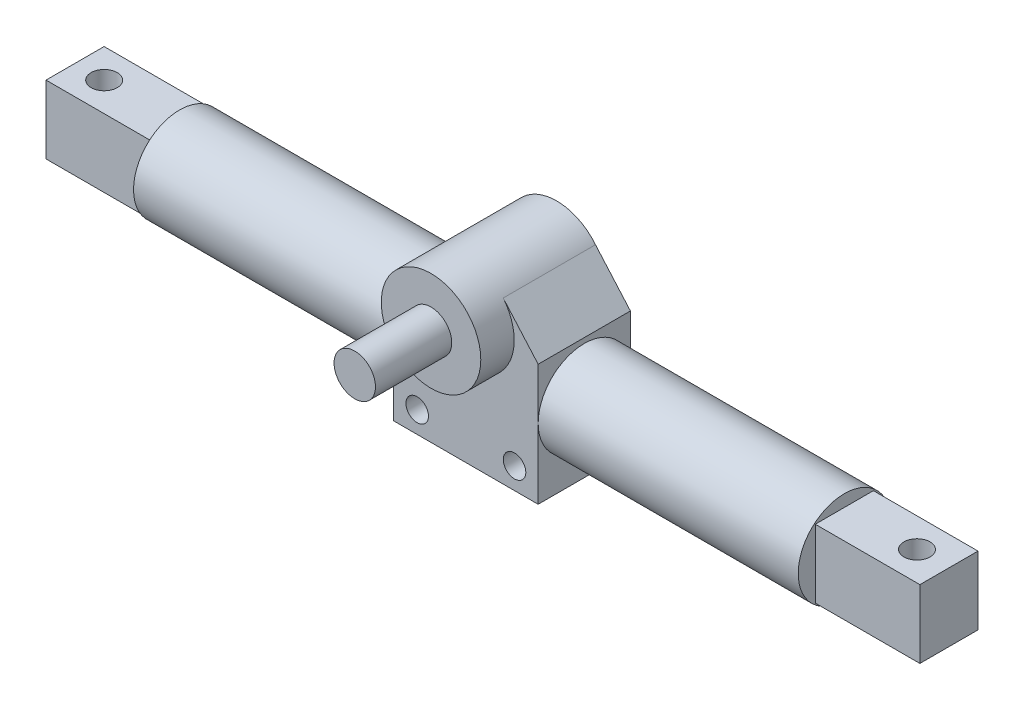
ISO-10303-21;
HEADER;
FILE_DESCRIPTION(('STEP AP214'),'2;1');
FILE_NAME('part.step','',(''),(''),'','','');
FILE_SCHEMA(('AUTOMOTIVE_DESIGN { 1 0 10303 214 1 1 1 1 }'));
ENDSEC;
DATA;
#1=APPLICATION_CONTEXT('core data for automotive mechanical design processes');
#2=APPLICATION_PROTOCOL_DEFINITION('international standard','automotive_design',2000,#1);
#3=PRODUCT_CONTEXT('',#1,'mechanical');
#4=PRODUCT('Part','Part','',(#3));
#5=PRODUCT_RELATED_PRODUCT_CATEGORY('part','',(#4));
#6=PRODUCT_DEFINITION_FORMATION('','',#4);
#7=PRODUCT_DEFINITION_CONTEXT('part definition',#1,'design');
#8=PRODUCT_DEFINITION('design','',#6,#7);
#9=PRODUCT_DEFINITION_SHAPE('','',#8);
#10=(LENGTH_UNIT() NAMED_UNIT(*) SI_UNIT(.MILLI.,.METRE.));
#11=(NAMED_UNIT(*) PLANE_ANGLE_UNIT() SI_UNIT($,.RADIAN.));
#12=(NAMED_UNIT(*) SI_UNIT($,.STERADIAN.) SOLID_ANGLE_UNIT());
#13=UNCERTAINTY_MEASURE_WITH_UNIT(LENGTH_MEASURE(1.E-05),#10,'distance_accuracy_value','');
#14=(GEOMETRIC_REPRESENTATION_CONTEXT(3) GLOBAL_UNCERTAINTY_ASSIGNED_CONTEXT((#13)) GLOBAL_UNIT_ASSIGNED_CONTEXT((#10,
#11,#12)) REPRESENTATION_CONTEXT('',''));
#15=CARTESIAN_POINT('',(0.,0.,0.));
#16=DIRECTION('',(0.,0.,1.));
#17=DIRECTION('',(1.,0.,0.));
#18=AXIS2_PLACEMENT_3D('',#15,#16,#17);
#19=CARTESIAN_POINT('',(50.546,0.,32.258));
#20=DIRECTION('',(-1.,0.,0.));
#21=DIRECTION('',(0.,0.,1.));
#22=AXIS2_PLACEMENT_3D('',#19,#20,#21);
#23=PLANE('',#22);
#24=CARTESIAN_POINT('',(50.546,24.511,16.129));
#25=DIRECTION('',(1.,0.,0.));
#26=DIRECTION('',(0.,0.,-1.));
#27=AXIS2_PLACEMENT_3D('',#24,#25,#26);
#28=CIRCLE('',#27,16.129);
#29=CARTESIAN_POINT('',(50.546,24.511,0.));
#30=VERTEX_POINT('',#29);
#31=CARTESIAN_POINT('',(50.546,24.511,32.258));
#32=VERTEX_POINT('',#31);
#33=EDGE_CURVE('E226',#30,#32,#28,.T.);
#34=ORIENTED_EDGE('',*,*,#33,.F.);
#35=DIRECTION('',(0.,1.,0.));
#36=VECTOR('',#35,1.);
#37=CARTESIAN_POINT('',(50.546,0.,0.));
#38=LINE('',#37,#36);
#39=CARTESIAN_POINT('',(50.546,42.418,0.));
#40=VERTEX_POINT('',#39);
#41=EDGE_CURVE('E272',#30,#40,#38,.T.);
#42=ORIENTED_EDGE('',*,*,#41,.T.);
#43=DIRECTION('',(0.,0.,-1.));
#44=VECTOR('',#43,1.);
#45=CARTESIAN_POINT('',(50.546,42.418,32.258));
#46=LINE('',#45,#44);
#47=CARTESIAN_POINT('',(50.546,42.418,32.258));
#48=VERTEX_POINT('',#47);
#49=EDGE_CURVE('E276',#48,#40,#46,.T.);
#50=ORIENTED_EDGE('',*,*,#49,.F.);
#51=DIRECTION('',(0.,1.,0.));
#52=VECTOR('',#51,1.);
#53=CARTESIAN_POINT('',(50.546,0.,32.258));
#54=LINE('',#53,#52);
#55=EDGE_CURVE('E262',#32,#48,#54,.T.);
#56=ORIENTED_EDGE('',*,*,#55,.F.);
#57=EDGE_LOOP('',(#34,#42,#50,#56));
#58=FACE_BOUND('',#57,.T.);
#59=ADVANCED_FACE('F33',(#58),#23,.F.);
#60=CARTESIAN_POINT('',(0.,0.,32.258));
#61=DIRECTION('',(1.,0.,0.));
#62=DIRECTION('',(0.,0.,-1.));
#63=AXIS2_PLACEMENT_3D('',#60,#61,#62);
#64=PLANE('',#63);
#65=CARTESIAN_POINT('',(0.,24.511,16.129));
#66=DIRECTION('',(-1.,0.,0.));
#67=DIRECTION('',(0.,0.,1.));
#68=AXIS2_PLACEMENT_3D('',#65,#66,#67);
#69=CIRCLE('',#68,16.129);
#70=CARTESIAN_POINT('',(0.,24.511,32.258));
#71=VERTEX_POINT('',#70);
#72=CARTESIAN_POINT('',(0.,24.511,0.));
#73=VERTEX_POINT('',#72);
#74=EDGE_CURVE('E225',#71,#73,#69,.T.);
#75=ORIENTED_EDGE('',*,*,#74,.F.);
#76=DIRECTION('',(0.,-1.,0.));
#77=VECTOR('',#76,1.);
#78=CARTESIAN_POINT('',(0.,0.,32.258));
#79=LINE('',#78,#77);
#80=CARTESIAN_POINT('',(0.,42.418,32.258));
#81=VERTEX_POINT('',#80);
#82=EDGE_CURVE('E257',#81,#71,#79,.T.);
#83=ORIENTED_EDGE('',*,*,#82,.F.);
#84=DIRECTION('',(0.,0.,-1.));
#85=VECTOR('',#84,1.);
#86=CARTESIAN_POINT('',(0.,42.418,32.258));
#87=LINE('',#86,#85);
#88=CARTESIAN_POINT('',(0.,42.418,0.));
#89=VERTEX_POINT('',#88);
#90=EDGE_CURVE('E266',#81,#89,#87,.T.);
#91=ORIENTED_EDGE('',*,*,#90,.T.);
#92=DIRECTION('',(0.,-1.,0.));
#93=VECTOR('',#92,1.);
#94=CARTESIAN_POINT('',(0.,0.,0.));
#95=LINE('',#94,#93);
#96=EDGE_CURVE('E267',#89,#73,#95,.T.);
#97=ORIENTED_EDGE('',*,*,#96,.T.);
#98=EDGE_LOOP('',(#75,#83,#91,#97));
#99=FACE_BOUND('',#98,.T.);
#100=ADVANCED_FACE('F332',(#99),#64,.F.);
#101=EDGE_CURVE('E236',#73,#71,#69,.T.);
#102=ORIENTED_EDGE('',*,*,#101,.F.);
#103=CARTESIAN_POINT('',(0.,0.,0.));
#104=VERTEX_POINT('',#103);
#105=EDGE_CURVE('E255',#73,#104,#95,.T.);
#106=ORIENTED_EDGE('',*,*,#105,.T.);
#107=DIRECTION('',(0.,0.,-1.));
#108=VECTOR('',#107,1.);
#109=CARTESIAN_POINT('',(0.,0.,32.258));
#110=LINE('',#109,#108);
#111=CARTESIAN_POINT('',(0.,0.,32.258));
#112=VERTEX_POINT('',#111);
#113=EDGE_CURVE('E282',#112,#104,#110,.T.);
#114=ORIENTED_EDGE('',*,*,#113,.F.);
#115=EDGE_CURVE('E260',#71,#112,#79,.T.);
#116=ORIENTED_EDGE('',*,*,#115,.F.);
#117=EDGE_LOOP('',(#102,#106,#114,#116));
#118=FACE_BOUND('',#117,.T.);
#119=ADVANCED_FACE('F35',(#118),#64,.F.);
#120=CARTESIAN_POINT('',(0.,0.,32.258));
#121=DIRECTION('',(0.,1.,0.));
#122=DIRECTION('',(0.,0.,1.));
#123=AXIS2_PLACEMENT_3D('',#120,#121,#122);
#124=PLANE('',#123);
#125=DIRECTION('',(1.,0.,0.));
#126=VECTOR('',#125,1.);
#127=CARTESIAN_POINT('',(0.,0.,0.));
#128=LINE('',#127,#126);
#129=CARTESIAN_POINT('',(50.546,0.,0.));
#130=VERTEX_POINT('',#129);
#131=EDGE_CURVE('E270',#104,#130,#128,.T.);
#132=ORIENTED_EDGE('',*,*,#131,.T.);
#133=DIRECTION('',(0.,0.,-1.));
#134=VECTOR('',#133,1.);
#135=CARTESIAN_POINT('',(50.546,0.,32.258));
#136=LINE('',#135,#134);
#137=CARTESIAN_POINT('',(50.546,0.,32.258));
#138=VERTEX_POINT('',#137);
#139=EDGE_CURVE('E279',#138,#130,#136,.T.);
#140=ORIENTED_EDGE('',*,*,#139,.F.);
#141=DIRECTION('',(1.,0.,0.));
#142=VECTOR('',#141,1.);
#143=CARTESIAN_POINT('',(0.,0.,32.258));
#144=LINE('',#143,#142);
#145=EDGE_CURVE('E259',#112,#138,#144,.T.);
#146=ORIENTED_EDGE('',*,*,#145,.F.);
#147=ORIENTED_EDGE('',*,*,#113,.T.);
#148=EDGE_LOOP('',(#132,#140,#146,#147));
#149=FACE_BOUND('',#148,.T.);
#150=ADVANCED_FACE('F363',(#149),#124,.F.);
#151=EDGE_CURVE('E42',#32,#30,#28,.T.);
#152=ORIENTED_EDGE('',*,*,#151,.F.);
#153=EDGE_CURVE('E263',#138,#32,#54,.T.);
#154=ORIENTED_EDGE('',*,*,#153,.F.);
#155=ORIENTED_EDGE('',*,*,#139,.T.);
#156=EDGE_CURVE('E273',#130,#30,#38,.T.);
#157=ORIENTED_EDGE('',*,*,#156,.T.);
#158=EDGE_LOOP('',(#152,#154,#155,#157));
#159=FACE_BOUND('',#158,.T.);
#160=ADVANCED_FACE('F358',(#159),#23,.F.);
#161=CARTESIAN_POINT('',(0.,0.,32.258));
#162=DIRECTION('',(0.,0.,-1.));
#163=DIRECTION('',(-1.,0.,0.));
#164=AXIS2_PLACEMENT_3D('',#161,#162,#163);
#165=PLANE('',#164);
#166=CARTESIAN_POINT('',(24.7758278646896,45.466,32.258));
#167=DIRECTION('',(0.,0.,1.));
#168=DIRECTION('',(1.,0.,0.));
#169=AXIS2_PLACEMENT_3D('',#166,#167,#168);
#170=CIRCLE('',#169,17.399);
#171=CARTESIAN_POINT('',(11.2160382075937,56.3681697590578,32.258));
#172=VERTEX_POINT('',#171);
#173=CARTESIAN_POINT('',(38.3356175217855,56.3681697590578,32.258));
#174=VERTEX_POINT('',#173);
#175=EDGE_CURVE('E208',#172,#174,#170,.T.);
#176=ORIENTED_EDGE('',*,*,#175,.F.);
#177=DIRECTION('',(-0.62659749175572,-0.779343045985169,0.));
#178=VECTOR('',#177,1.);
#179=CARTESIAN_POINT('',(0.,42.418,32.258));
#180=LINE('',#179,#178);
#181=EDGE_CURVE('E241',#172,#81,#180,.T.);
#182=ORIENTED_EDGE('',*,*,#181,.T.);
#183=ORIENTED_EDGE('',*,*,#82,.T.);
#184=ORIENTED_EDGE('',*,*,#115,.T.);
#185=ORIENTED_EDGE('',*,*,#145,.T.);
#186=ORIENTED_EDGE('',*,*,#153,.T.);
#187=ORIENTED_EDGE('',*,*,#55,.T.);
#188=DIRECTION('',(-0.658626308629029,0.752470189164793,0.));
#189=VECTOR('',#188,1.);
#190=CARTESIAN_POINT('',(50.546,42.418,32.258));
#191=LINE('',#190,#189);
#192=EDGE_CURVE('E233',#48,#174,#191,.T.);
#193=ORIENTED_EDGE('',*,*,#192,.T.);
#194=EDGE_LOOP('',(#176,#182,#183,#184,#185,#186,#187,#193));
#195=FACE_BOUND('',#194,.T.);
#196=CARTESIAN_POINT('',(42.291,7.493,32.258));
#197=DIRECTION('',(0.,0.,1.));
#198=DIRECTION('',(1.,0.,0.));
#199=AXIS2_PLACEMENT_3D('',#196,#197,#198);
#200=CIRCLE('',#199,3.93699999999999);
#201=CARTESIAN_POINT('',(46.228,7.493,32.258));
#202=VERTEX_POINT('',#201);
#203=EDGE_CURVE('E216',#202,#202,#200,.T.);
#204=ORIENTED_EDGE('',*,*,#203,.F.);
#205=EDGE_LOOP('',(#204));
#206=FACE_BOUND('',#205,.T.);
#207=CARTESIAN_POINT('',(8.255,7.493,32.258));
#208=DIRECTION('',(0.,0.,1.));
#209=DIRECTION('',(-1.,0.,0.));
#210=AXIS2_PLACEMENT_3D('',#207,#208,#209);
#211=CIRCLE('',#210,3.93699999999999);
#212=CARTESIAN_POINT('',(4.318,7.493,32.258));
#213=VERTEX_POINT('',#212);
#214=EDGE_CURVE('E213',#213,#213,#211,.T.);
#215=ORIENTED_EDGE('',*,*,#214,.F.);
#216=EDGE_LOOP('',(#215));
#217=FACE_BOUND('',#216,.T.);
#218=ADVANCED_FACE('F386',(#195,#206,#217),#165,.F.);
#219=CARTESIAN_POINT('',(0.,0.,0.));
#220=DIRECTION('',(0.,0.,-1.));
#221=DIRECTION('',(-1.,0.,0.));
#222=AXIS2_PLACEMENT_3D('',#219,#220,#221);
#223=PLANE('',#222);
#224=CARTESIAN_POINT('',(42.291,7.493,0.));
#225=DIRECTION('',(0.,0.,-1.));
#226=DIRECTION('',(-1.,0.,0.));
#227=AXIS2_PLACEMENT_3D('',#224,#225,#226);
#228=CIRCLE('',#227,3.93699999999999);
#229=CARTESIAN_POINT('',(38.354,7.493,0.));
#230=VERTEX_POINT('',#229);
#231=EDGE_CURVE('E229',#230,#230,#228,.T.);
#232=ORIENTED_EDGE('',*,*,#231,.F.);
#233=EDGE_LOOP('',(#232));
#234=FACE_BOUND('',#233,.T.);
#235=CARTESIAN_POINT('',(8.255,7.493,0.));
#236=DIRECTION('',(0.,0.,-1.));
#237=DIRECTION('',(-1.,0.,0.));
#238=AXIS2_PLACEMENT_3D('',#235,#236,#237);
#239=CIRCLE('',#238,3.93699999999999);
#240=CARTESIAN_POINT('',(4.318,7.493,0.));
#241=VERTEX_POINT('',#240);
#242=EDGE_CURVE('E219',#241,#241,#239,.T.);
#243=ORIENTED_EDGE('',*,*,#242,.F.);
#244=EDGE_LOOP('',(#243));
#245=FACE_BOUND('',#244,.T.);
#246=ORIENTED_EDGE('',*,*,#96,.F.);
#247=DIRECTION('',(-0.62659749175572,-0.779343045985169,0.));
#248=VECTOR('',#247,1.);
#249=CARTESIAN_POINT('',(0.,42.418,0.));
#250=LINE('',#249,#248);
#251=CARTESIAN_POINT('',(11.2160382075937,56.3681697590578,0.));
#252=VERTEX_POINT('',#251);
#253=EDGE_CURVE('E244',#252,#89,#250,.T.);
#254=ORIENTED_EDGE('',*,*,#253,.F.);
#255=CARTESIAN_POINT('',(24.7758278646896,45.466,0.));
#256=DIRECTION('',(0.,0.,1.));
#257=DIRECTION('',(1.,0.,0.));
#258=AXIS2_PLACEMENT_3D('',#255,#256,#257);
#259=CIRCLE('',#258,17.399);
#260=CARTESIAN_POINT('',(38.3356175217855,56.3681697590578,0.));
#261=VERTEX_POINT('',#260);
#262=EDGE_CURVE('E240',#261,#252,#259,.T.);
#263=ORIENTED_EDGE('',*,*,#262,.F.);
#264=DIRECTION('',(-0.658626308629029,0.752470189164793,0.));
#265=VECTOR('',#264,1.);
#266=CARTESIAN_POINT('',(50.546,42.418,0.));
#267=LINE('',#266,#265);
#268=EDGE_CURVE('E237',#40,#261,#267,.T.);
#269=ORIENTED_EDGE('',*,*,#268,.F.);
#270=ORIENTED_EDGE('',*,*,#41,.F.);
#271=ORIENTED_EDGE('',*,*,#156,.F.);
#272=ORIENTED_EDGE('',*,*,#131,.F.);
#273=ORIENTED_EDGE('',*,*,#105,.F.);
#274=EDGE_LOOP('',(#246,#254,#263,#269,#270,#271,#272,#273));
#275=FACE_BOUND('',#274,.T.);
#276=ADVANCED_FACE('F338',(#234,#245,#275),#223,.T.);
#277=CARTESIAN_POINT('',(0.,42.418,0.));
#278=DIRECTION('',(-0.779343045985169,0.62659749175572,0.));
#279=DIRECTION('',(-0.62659749175572,-0.779343045985169,0.));
#280=AXIS2_PLACEMENT_3D('',#277,#278,#279);
#281=PLANE('',#280);
#282=ORIENTED_EDGE('',*,*,#181,.F.);
#283=DIRECTION('',(0.,0.,1.));
#284=VECTOR('',#283,1.);
#285=CARTESIAN_POINT('',(11.2160382075937,56.3681697590578,0.));
#286=LINE('',#285,#284);
#287=EDGE_CURVE('E252',#252,#172,#286,.T.);
#288=ORIENTED_EDGE('',*,*,#287,.F.);
#289=ORIENTED_EDGE('',*,*,#253,.T.);
#290=ORIENTED_EDGE('',*,*,#90,.F.);
#291=EDGE_LOOP('',(#282,#288,#289,#290));
#292=FACE_BOUND('',#291,.T.);
#293=ADVANCED_FACE('F342',(#292),#281,.T.);
#294=CARTESIAN_POINT('',(24.7758278646896,45.466,0.));
#295=DIRECTION('',(0.,0.,1.));
#296=DIRECTION('',(1.,0.,0.));
#297=AXIS2_PLACEMENT_3D('',#294,#295,#296);
#298=CYLINDRICAL_SURFACE('',#297,17.399);
#299=ORIENTED_EDGE('',*,*,#287,.T.);
#300=ORIENTED_EDGE('',*,*,#175,.T.);
#301=DIRECTION('',(0.,0.,1.));
#302=VECTOR('',#301,1.);
#303=CARTESIAN_POINT('',(38.3356175217855,56.3681697590578,0.));
#304=LINE('',#303,#302);
#305=EDGE_CURVE('E247',#261,#174,#304,.T.);
#306=ORIENTED_EDGE('',*,*,#305,.F.);
#307=ORIENTED_EDGE('',*,*,#262,.T.);
#308=EDGE_LOOP('',(#299,#300,#306,#307));
#309=FACE_BOUND('',#308,.T.);
#310=CARTESIAN_POINT('',(24.7758278646896,45.466,43.942));
#311=DIRECTION('',(0.,0.,1.));
#312=DIRECTION('',(1.,0.,0.));
#313=AXIS2_PLACEMENT_3D('',#310,#311,#312);
#314=CIRCLE('',#313,17.399);
#315=CARTESIAN_POINT('',(42.1748278646896,45.466,43.942));
#316=VERTEX_POINT('',#315);
#317=EDGE_CURVE('E210',#316,#316,#314,.T.);
#318=ORIENTED_EDGE('',*,*,#317,.F.);
#319=EDGE_LOOP('',(#318));
#320=FACE_BOUND('',#319,.T.);
#321=ADVANCED_FACE('F345',(#309,#320),#298,.T.);
#322=CARTESIAN_POINT('',(50.546,42.418,0.));
#323=DIRECTION('',(0.752470189164793,0.658626308629029,0.));
#324=DIRECTION('',(-0.658626308629029,0.752470189164793,0.));
#325=AXIS2_PLACEMENT_3D('',#322,#323,#324);
#326=PLANE('',#325);
#327=ORIENTED_EDGE('',*,*,#192,.F.);
#328=ORIENTED_EDGE('',*,*,#49,.T.);
#329=ORIENTED_EDGE('',*,*,#268,.T.);
#330=ORIENTED_EDGE('',*,*,#305,.T.);
#331=EDGE_LOOP('',(#327,#328,#329,#330));
#332=FACE_BOUND('',#331,.T.);
#333=ADVANCED_FACE('F327',(#332),#326,.T.);
#334=CARTESIAN_POINT('',(-90.932,24.511,16.129));
#335=DIRECTION('',(1.,0.,0.));
#336=DIRECTION('',(0.,0.,-1.));
#337=AXIS2_PLACEMENT_3D('',#334,#335,#336);
#338=CYLINDRICAL_SURFACE('',#337,16.129);
#339=CARTESIAN_POINT('',(-90.932,24.511,16.129));
#340=DIRECTION('',(-1.,0.,0.));
#341=DIRECTION('',(0.,0.,1.));
#342=AXIS2_PLACEMENT_3D('',#339,#340,#341);
#343=CIRCLE('',#342,16.129);
#344=CARTESIAN_POINT('',(-90.932,24.511,32.258));
#345=VERTEX_POINT('',#344);
#346=EDGE_CURVE('E230',#345,#345,#343,.T.);
#347=ORIENTED_EDGE('',*,*,#346,.F.);
#348=EDGE_LOOP('',(#347));
#349=FACE_BOUND('',#348,.T.);
#350=ORIENTED_EDGE('',*,*,#74,.T.);
#351=ORIENTED_EDGE('',*,*,#101,.T.);
#352=EDGE_LOOP('',(#350,#351));
#353=FACE_BOUND('',#352,.T.);
#354=ADVANCED_FACE('F321',(#349,#353),#338,.T.);
#355=CARTESIAN_POINT('',(-90.932,24.511,16.129));
#356=DIRECTION('',(-1.,0.,0.));
#357=DIRECTION('',(0.,0.,1.));
#358=AXIS2_PLACEMENT_3D('',#355,#356,#357);
#359=PLANE('',#358);
#360=DIRECTION('',(0.,1.,0.));
#361=VECTOR('',#360,1.);
#362=CARTESIAN_POINT('',(-90.932,36.449,26.289));
#363=LINE('',#362,#361);
#364=CARTESIAN_POINT('',(-90.932,12.573,26.289));
#365=VERTEX_POINT('',#364);
#366=CARTESIAN_POINT('',(-90.932,36.449,26.289));
#367=VERTEX_POINT('',#366);
#368=EDGE_CURVE('E50',#365,#367,#363,.T.);
#369=ORIENTED_EDGE('',*,*,#368,.F.);
#370=DIRECTION('',(0.,0.,1.));
#371=VECTOR('',#370,1.);
#372=CARTESIAN_POINT('',(-90.932,12.573,5.96900000000001));
#373=LINE('',#372,#371);
#374=CARTESIAN_POINT('',(-90.932,12.573,5.96900000000001));
#375=VERTEX_POINT('',#374);
#376=EDGE_CURVE('E54',#375,#365,#373,.T.);
#377=ORIENTED_EDGE('',*,*,#376,.F.);
#378=DIRECTION('',(0.,-1.,0.));
#379=VECTOR('',#378,1.);
#380=CARTESIAN_POINT('',(-90.932,36.449,5.969));
#381=LINE('',#380,#379);
#382=CARTESIAN_POINT('',(-90.932,36.449,5.969));
#383=VERTEX_POINT('',#382);
#384=EDGE_CURVE('E308',#383,#375,#381,.T.);
#385=ORIENTED_EDGE('',*,*,#384,.F.);
#386=DIRECTION('',(0.,0.,-1.));
#387=VECTOR('',#386,1.);
#388=CARTESIAN_POINT('',(-90.932,36.449,5.969));
#389=LINE('',#388,#387);
#390=EDGE_CURVE('E306',#367,#383,#389,.T.);
#391=ORIENTED_EDGE('',*,*,#390,.F.);
#392=EDGE_LOOP('',(#369,#377,#385,#391));
#393=FACE_BOUND('',#392,.T.);
#394=ORIENTED_EDGE('',*,*,#346,.T.);
#395=EDGE_LOOP('',(#394));
#396=FACE_BOUND('',#395,.T.);
#397=ADVANCED_FACE('F317',(#393,#396),#359,.T.);
#398=CARTESIAN_POINT('',(141.478,24.511,16.129));
#399=DIRECTION('',(-1.,0.,0.));
#400=DIRECTION('',(0.,0.,1.));
#401=AXIS2_PLACEMENT_3D('',#398,#399,#400);
#402=CYLINDRICAL_SURFACE('',#401,16.129);
#403=CARTESIAN_POINT('',(141.478,24.511,16.129));
#404=DIRECTION('',(1.,0.,0.));
#405=DIRECTION('',(0.,0.,-1.));
#406=AXIS2_PLACEMENT_3D('',#403,#404,#405);
#407=CIRCLE('',#406,16.129);
#408=CARTESIAN_POINT('',(141.478,24.511,0.));
#409=VERTEX_POINT('',#408);
#410=EDGE_CURVE('E222',#409,#409,#407,.T.);
#411=ORIENTED_EDGE('',*,*,#410,.F.);
#412=EDGE_LOOP('',(#411));
#413=FACE_BOUND('',#412,.T.);
#414=ORIENTED_EDGE('',*,*,#33,.T.);
#415=ORIENTED_EDGE('',*,*,#151,.T.);
#416=EDGE_LOOP('',(#414,#415));
#417=FACE_BOUND('',#416,.T.);
#418=ADVANCED_FACE('F320',(#413,#417),#402,.T.);
#419=CARTESIAN_POINT('',(141.478,24.511,16.129));
#420=DIRECTION('',(1.,0.,0.));
#421=DIRECTION('',(0.,0.,-1.));
#422=AXIS2_PLACEMENT_3D('',#419,#420,#421);
#423=PLANE('',#422);
#424=DIRECTION('',(0.,1.,0.));
#425=VECTOR('',#424,1.);
#426=CARTESIAN_POINT('',(141.478,36.449,5.969));
#427=LINE('',#426,#425);
#428=CARTESIAN_POINT('',(141.478,12.573,5.969));
#429=VERTEX_POINT('',#428);
#430=CARTESIAN_POINT('',(141.478,36.449,5.969));
#431=VERTEX_POINT('',#430);
#432=EDGE_CURVE('E168',#429,#431,#427,.T.);
#433=ORIENTED_EDGE('',*,*,#432,.F.);
#434=DIRECTION('',(0.,0.,-1.));
#435=VECTOR('',#434,1.);
#436=CARTESIAN_POINT('',(141.478,12.573,26.289));
#437=LINE('',#436,#435);
#438=CARTESIAN_POINT('',(141.478,12.573,26.289));
#439=VERTEX_POINT('',#438);
#440=EDGE_CURVE('E181',#439,#429,#437,.T.);
#441=ORIENTED_EDGE('',*,*,#440,.F.);
#442=DIRECTION('',(0.,-1.,0.));
#443=VECTOR('',#442,1.);
#444=CARTESIAN_POINT('',(141.478,36.449,26.289));
#445=LINE('',#444,#443);
#446=CARTESIAN_POINT('',(141.478,36.449,26.289));
#447=VERTEX_POINT('',#446);
#448=EDGE_CURVE('E190',#447,#439,#445,.T.);
#449=ORIENTED_EDGE('',*,*,#448,.F.);
#450=DIRECTION('',(0.,0.,1.));
#451=VECTOR('',#450,1.);
#452=CARTESIAN_POINT('',(141.478,36.449,26.289));
#453=LINE('',#452,#451);
#454=EDGE_CURVE('E171',#431,#447,#453,.T.);
#455=ORIENTED_EDGE('',*,*,#454,.F.);
#456=EDGE_LOOP('',(#433,#441,#449,#455));
#457=FACE_BOUND('',#456,.T.);
#458=ORIENTED_EDGE('',*,*,#410,.T.);
#459=EDGE_LOOP('',(#458));
#460=FACE_BOUND('',#459,.T.);
#461=ADVANCED_FACE('F369',(#457,#460),#423,.T.);
#462=CARTESIAN_POINT('',(8.255,7.493,-58.674));
#463=DIRECTION('',(0.,0.,1.));
#464=DIRECTION('',(1.,0.,0.));
#465=AXIS2_PLACEMENT_3D('',#462,#463,#464);
#466=CYLINDRICAL_SURFACE('',#465,3.93699999999999);
#467=ORIENTED_EDGE('',*,*,#242,.T.);
#468=EDGE_LOOP('',(#467));
#469=FACE_BOUND('',#468,.T.);
#470=ORIENTED_EDGE('',*,*,#214,.T.);
#471=EDGE_LOOP('',(#470));
#472=FACE_BOUND('',#471,.T.);
#473=ADVANCED_FACE('F375',(#469,#472),#466,.F.);
#474=CARTESIAN_POINT('',(42.291,7.493,-58.674));
#475=DIRECTION('',(0.,0.,1.));
#476=DIRECTION('',(1.,0.,0.));
#477=AXIS2_PLACEMENT_3D('',#474,#475,#476);
#478=CYLINDRICAL_SURFACE('',#477,3.93699999999999);
#479=ORIENTED_EDGE('',*,*,#231,.T.);
#480=EDGE_LOOP('',(#479));
#481=FACE_BOUND('',#480,.T.);
#482=ORIENTED_EDGE('',*,*,#203,.T.);
#483=EDGE_LOOP('',(#482));
#484=FACE_BOUND('',#483,.T.);
#485=ADVANCED_FACE('F454',(#481,#484),#478,.F.);
#486=CARTESIAN_POINT('',(24.7758278646896,45.466,43.942));
#487=DIRECTION('',(0.,0.,1.));
#488=DIRECTION('',(1.,0.,0.));
#489=AXIS2_PLACEMENT_3D('',#486,#487,#488);
#490=PLANE('',#489);
#491=CARTESIAN_POINT('',(24.7758278646896,45.466,43.942));
#492=DIRECTION('',(0.,0.,1.));
#493=DIRECTION('',(1.,0.,0.));
#494=AXIS2_PLACEMENT_3D('',#491,#492,#493);
#495=CIRCLE('',#494,7.239);
#496=CARTESIAN_POINT('',(32.0148278646896,45.466,43.942));
#497=VERTEX_POINT('',#496);
#498=EDGE_CURVE('E11',#497,#497,#495,.T.);
#499=ORIENTED_EDGE('',*,*,#498,.F.);
#500=EDGE_LOOP('',(#499));
#501=FACE_BOUND('',#500,.T.);
#502=ORIENTED_EDGE('',*,*,#317,.T.);
#503=EDGE_LOOP('',(#502));
#504=FACE_BOUND('',#503,.T.);
#505=ADVANCED_FACE('F464',(#501,#504),#490,.T.);
#506=CARTESIAN_POINT('',(24.7758278646896,45.466,70.612));
#507=DIRECTION('',(0.,0.,-1.));
#508=DIRECTION('',(-1.,0.,0.));
#509=AXIS2_PLACEMENT_3D('',#506,#507,#508);
#510=CYLINDRICAL_SURFACE('',#509,7.239);
#511=CARTESIAN_POINT('',(24.7758278646896,45.466,70.612));
#512=DIRECTION('',(0.,0.,1.));
#513=DIRECTION('',(1.,0.,0.));
#514=AXIS2_PLACEMENT_3D('',#511,#512,#513);
#515=CIRCLE('',#514,7.239);
#516=CARTESIAN_POINT('',(32.0148278646896,45.466,70.612));
#517=VERTEX_POINT('',#516);
#518=EDGE_CURVE('E206',#517,#517,#515,.T.);
#519=ORIENTED_EDGE('',*,*,#518,.F.);
#520=EDGE_LOOP('',(#519));
#521=FACE_BOUND('',#520,.T.);
#522=ORIENTED_EDGE('',*,*,#498,.T.);
#523=EDGE_LOOP('',(#522));
#524=FACE_BOUND('',#523,.T.);
#525=ADVANCED_FACE('F491',(#521,#524),#510,.T.);
#526=CARTESIAN_POINT('',(24.7758278646896,45.466,70.612));
#527=DIRECTION('',(0.,0.,1.));
#528=DIRECTION('',(1.,0.,0.));
#529=AXIS2_PLACEMENT_3D('',#526,#527,#528);
#530=PLANE('',#529);
#531=ORIENTED_EDGE('',*,*,#518,.T.);
#532=EDGE_LOOP('',(#531));
#533=FACE_BOUND('',#532,.T.);
#534=ADVANCED_FACE('F501',(#533),#530,.T.);
#535=CARTESIAN_POINT('',(178.054,36.449,5.969));
#536=DIRECTION('',(0.,0.,1.));
#537=DIRECTION('',(0.,-1.,0.));
#538=AXIS2_PLACEMENT_3D('',#535,#536,#537);
#539=PLANE('',#538);
#540=ORIENTED_EDGE('',*,*,#432,.T.);
#541=DIRECTION('',(-1.,0.,0.));
#542=VECTOR('',#541,1.);
#543=CARTESIAN_POINT('',(178.054,36.449,5.969));
#544=LINE('',#543,#542);
#545=CARTESIAN_POINT('',(178.054,36.449,5.969));
#546=VERTEX_POINT('',#545);
#547=EDGE_CURVE('E203',#546,#431,#544,.T.);
#548=ORIENTED_EDGE('',*,*,#547,.F.);
#549=DIRECTION('',(0.,1.,0.));
#550=VECTOR('',#549,1.);
#551=CARTESIAN_POINT('',(178.054,36.449,5.969));
#552=LINE('',#551,#550);
#553=CARTESIAN_POINT('',(178.054,12.573,5.969));
#554=VERTEX_POINT('',#553);
#555=EDGE_CURVE('E177',#554,#546,#552,.T.);
#556=ORIENTED_EDGE('',*,*,#555,.F.);
#557=DIRECTION('',(-1.,0.,0.));
#558=VECTOR('',#557,1.);
#559=CARTESIAN_POINT('',(178.054,12.573,5.969));
#560=LINE('',#559,#558);
#561=EDGE_CURVE('E186',#554,#429,#560,.T.);
#562=ORIENTED_EDGE('',*,*,#561,.T.);
#563=EDGE_LOOP('',(#540,#548,#556,#562));
#564=FACE_BOUND('',#563,.T.);
#565=ADVANCED_FACE('F511',(#564),#539,.F.);
#566=CARTESIAN_POINT('',(178.054,36.449,26.289));
#567=DIRECTION('',(0.,-1.,0.));
#568=DIRECTION('',(0.,0.,-1.));
#569=AXIS2_PLACEMENT_3D('',#566,#567,#568);
#570=PLANE('',#569);
#571=CARTESIAN_POINT('',(166.878,36.449,16.129));
#572=DIRECTION('',(0.,1.,0.));
#573=DIRECTION('',(0.,0.,1.));
#574=AXIS2_PLACEMENT_3D('',#571,#572,#573);
#575=CIRCLE('',#574,4.57199999999999);
#576=CARTESIAN_POINT('',(166.878,36.449,20.701));
#577=VERTEX_POINT('',#576);
#578=EDGE_CURVE('E290',#577,#577,#575,.T.);
#579=ORIENTED_EDGE('',*,*,#578,.F.);
#580=EDGE_LOOP('',(#579));
#581=FACE_BOUND('',#580,.T.);
#582=ORIENTED_EDGE('',*,*,#454,.T.);
#583=DIRECTION('',(-1.,0.,0.));
#584=VECTOR('',#583,1.);
#585=CARTESIAN_POINT('',(178.054,36.449,26.289));
#586=LINE('',#585,#584);
#587=CARTESIAN_POINT('',(178.054,36.449,26.289));
#588=VERTEX_POINT('',#587);
#589=EDGE_CURVE('E200',#588,#447,#586,.T.);
#590=ORIENTED_EDGE('',*,*,#589,.F.);
#591=DIRECTION('',(0.,0.,1.));
#592=VECTOR('',#591,1.);
#593=CARTESIAN_POINT('',(178.054,36.449,26.289));
#594=LINE('',#593,#592);
#595=EDGE_CURVE('E180',#546,#588,#594,.T.);
#596=ORIENTED_EDGE('',*,*,#595,.F.);
#597=ORIENTED_EDGE('',*,*,#547,.T.);
#598=EDGE_LOOP('',(#582,#590,#596,#597));
#599=FACE_BOUND('',#598,.T.);
#600=ADVANCED_FACE('F526',(#581,#599),#570,.F.);
#601=CARTESIAN_POINT('',(178.054,36.449,26.289));
#602=DIRECTION('',(0.,0.,-1.));
#603=DIRECTION('',(0.,1.,0.));
#604=AXIS2_PLACEMENT_3D('',#601,#602,#603);
#605=PLANE('',#604);
#606=ORIENTED_EDGE('',*,*,#448,.T.);
#607=DIRECTION('',(-1.,0.,0.));
#608=VECTOR('',#607,1.);
#609=CARTESIAN_POINT('',(178.054,12.573,26.289));
#610=LINE('',#609,#608);
#611=CARTESIAN_POINT('',(178.054,12.573,26.289));
#612=VERTEX_POINT('',#611);
#613=EDGE_CURVE('E197',#612,#439,#610,.T.);
#614=ORIENTED_EDGE('',*,*,#613,.F.);
#615=DIRECTION('',(0.,-1.,0.));
#616=VECTOR('',#615,1.);
#617=CARTESIAN_POINT('',(178.054,36.449,26.289));
#618=LINE('',#617,#616);
#619=EDGE_CURVE('E183',#588,#612,#618,.T.);
#620=ORIENTED_EDGE('',*,*,#619,.F.);
#621=ORIENTED_EDGE('',*,*,#589,.T.);
#622=EDGE_LOOP('',(#606,#614,#620,#621));
#623=FACE_BOUND('',#622,.T.);
#624=ADVANCED_FACE('F534',(#623),#605,.F.);
#625=CARTESIAN_POINT('',(178.054,12.573,26.289));
#626=DIRECTION('',(0.,1.,0.));
#627=DIRECTION('',(0.,0.,1.));
#628=AXIS2_PLACEMENT_3D('',#625,#626,#627);
#629=PLANE('',#628);
#630=CARTESIAN_POINT('',(166.878,12.573,16.129));
#631=DIRECTION('',(0.,1.,0.));
#632=DIRECTION('',(0.,0.,1.));
#633=AXIS2_PLACEMENT_3D('',#630,#631,#632);
#634=CIRCLE('',#633,4.57199999999999);
#635=CARTESIAN_POINT('',(166.878,12.573,20.701));
#636=VERTEX_POINT('',#635);
#637=EDGE_CURVE('E37',#636,#636,#634,.T.);
#638=ORIENTED_EDGE('',*,*,#637,.T.);
#639=EDGE_LOOP('',(#638));
#640=FACE_BOUND('',#639,.T.);
#641=ORIENTED_EDGE('',*,*,#440,.T.);
#642=ORIENTED_EDGE('',*,*,#561,.F.);
#643=DIRECTION('',(0.,0.,-1.));
#644=VECTOR('',#643,1.);
#645=CARTESIAN_POINT('',(178.054,12.573,26.289));
#646=LINE('',#645,#644);
#647=EDGE_CURVE('E185',#612,#554,#646,.T.);
#648=ORIENTED_EDGE('',*,*,#647,.F.);
#649=ORIENTED_EDGE('',*,*,#613,.T.);
#650=EDGE_LOOP('',(#641,#642,#648,#649));
#651=FACE_BOUND('',#650,.T.);
#652=ADVANCED_FACE('F539',(#640,#651),#629,.F.);
#653=CARTESIAN_POINT('',(178.054,0.,0.));
#654=DIRECTION('',(1.,0.,0.));
#655=DIRECTION('',(0.,0.,-1.));
#656=AXIS2_PLACEMENT_3D('',#653,#654,#655);
#657=PLANE('',#656);
#658=ORIENTED_EDGE('',*,*,#555,.T.);
#659=ORIENTED_EDGE('',*,*,#595,.T.);
#660=ORIENTED_EDGE('',*,*,#619,.T.);
#661=ORIENTED_EDGE('',*,*,#647,.T.);
#662=EDGE_LOOP('',(#658,#659,#660,#661));
#663=FACE_BOUND('',#662,.T.);
#664=ADVANCED_FACE('F547',(#663),#657,.T.);
#665=CARTESIAN_POINT('',(-127.508,36.449,26.289));
#666=DIRECTION('',(0.,0.,-1.));
#667=DIRECTION('',(0.,1.,0.));
#668=AXIS2_PLACEMENT_3D('',#665,#666,#667);
#669=PLANE('',#668);
#670=ORIENTED_EDGE('',*,*,#368,.T.);
#671=DIRECTION('',(1.,0.,0.));
#672=VECTOR('',#671,1.);
#673=CARTESIAN_POINT('',(-127.508,36.449,26.289));
#674=LINE('',#673,#672);
#675=CARTESIAN_POINT('',(-127.508,36.449,26.289));
#676=VERTEX_POINT('',#675);
#677=EDGE_CURVE('E151',#676,#367,#674,.T.);
#678=ORIENTED_EDGE('',*,*,#677,.F.);
#679=DIRECTION('',(0.,1.,0.));
#680=VECTOR('',#679,1.);
#681=CARTESIAN_POINT('',(-127.508,36.449,26.289));
#682=LINE('',#681,#680);
#683=CARTESIAN_POINT('',(-127.508,12.573,26.289));
#684=VERTEX_POINT('',#683);
#685=EDGE_CURVE('E157',#684,#676,#682,.T.);
#686=ORIENTED_EDGE('',*,*,#685,.F.);
#687=DIRECTION('',(1.,0.,0.));
#688=VECTOR('',#687,1.);
#689=CARTESIAN_POINT('',(-127.508,12.573,26.289));
#690=LINE('',#689,#688);
#691=EDGE_CURVE('E304',#684,#365,#690,.T.);
#692=ORIENTED_EDGE('',*,*,#691,.T.);
#693=EDGE_LOOP('',(#670,#678,#686,#692));
#694=FACE_BOUND('',#693,.T.);
#695=ADVANCED_FACE('F167',(#694),#669,.F.);
#696=CARTESIAN_POINT('',(-127.508,36.449,5.969));
#697=DIRECTION('',(0.,-1.,0.));
#698=DIRECTION('',(0.,0.,-1.));
#699=AXIS2_PLACEMENT_3D('',#696,#697,#698);
#700=PLANE('',#699);
#701=CARTESIAN_POINT('',(-117.326344270621,36.449,16.129));
#702=DIRECTION('',(0.,1.,0.));
#703=DIRECTION('',(0.,0.,-1.));
#704=AXIS2_PLACEMENT_3D('',#701,#702,#703);
#705=CIRCLE('',#704,4.57199999999999);
#706=CARTESIAN_POINT('',(-117.326344270621,36.449,11.557));
#707=VERTEX_POINT('',#706);
#708=EDGE_CURVE('E295',#707,#707,#705,.T.);
#709=ORIENTED_EDGE('',*,*,#708,.F.);
#710=EDGE_LOOP('',(#709));
#711=FACE_BOUND('',#710,.T.);
#712=ORIENTED_EDGE('',*,*,#390,.T.);
#713=DIRECTION('',(1.,0.,0.));
#714=VECTOR('',#713,1.);
#715=CARTESIAN_POINT('',(-127.508,36.449,5.969));
#716=LINE('',#715,#714);
#717=CARTESIAN_POINT('',(-127.508,36.449,5.969));
#718=VERTEX_POINT('',#717);
#719=EDGE_CURVE('E153',#718,#383,#716,.T.);
#720=ORIENTED_EDGE('',*,*,#719,.F.);
#721=DIRECTION('',(0.,0.,-1.));
#722=VECTOR('',#721,1.);
#723=CARTESIAN_POINT('',(-127.508,36.449,5.969));
#724=LINE('',#723,#722);
#725=EDGE_CURVE('E146',#676,#718,#724,.T.);
#726=ORIENTED_EDGE('',*,*,#725,.F.);
#727=ORIENTED_EDGE('',*,*,#677,.T.);
#728=EDGE_LOOP('',(#712,#720,#726,#727));
#729=FACE_BOUND('',#728,.T.);
#730=ADVANCED_FACE('F149',(#711,#729),#700,.F.);
#731=CARTESIAN_POINT('',(-127.508,36.449,5.969));
#732=DIRECTION('',(0.,0.,1.));
#733=DIRECTION('',(0.,-1.,0.));
#734=AXIS2_PLACEMENT_3D('',#731,#732,#733);
#735=PLANE('',#734);
#736=ORIENTED_EDGE('',*,*,#384,.T.);
#737=DIRECTION('',(1.,0.,0.));
#738=VECTOR('',#737,1.);
#739=CARTESIAN_POINT('',(-127.508,12.573,5.96900000000001));
#740=LINE('',#739,#738);
#741=CARTESIAN_POINT('',(-127.508,12.573,5.96900000000001));
#742=VERTEX_POINT('',#741);
#743=EDGE_CURVE('E173',#742,#375,#740,.T.);
#744=ORIENTED_EDGE('',*,*,#743,.F.);
#745=DIRECTION('',(0.,-1.,0.));
#746=VECTOR('',#745,1.);
#747=CARTESIAN_POINT('',(-127.508,36.449,5.969));
#748=LINE('',#747,#746);
#749=EDGE_CURVE('E156',#718,#742,#748,.T.);
#750=ORIENTED_EDGE('',*,*,#749,.F.);
#751=ORIENTED_EDGE('',*,*,#719,.T.);
#752=EDGE_LOOP('',(#736,#744,#750,#751));
#753=FACE_BOUND('',#752,.T.);
#754=ADVANCED_FACE('F316',(#753),#735,.F.);
#755=CARTESIAN_POINT('',(-127.508,12.573,5.96900000000001));
#756=DIRECTION('',(0.,1.,0.));
#757=DIRECTION('',(0.,0.,1.));
#758=AXIS2_PLACEMENT_3D('',#755,#756,#757);
#759=PLANE('',#758);
#760=CARTESIAN_POINT('',(-117.326344270621,12.573,16.129));
#761=DIRECTION('',(0.,1.,0.));
#762=DIRECTION('',(0.,0.,1.));
#763=AXIS2_PLACEMENT_3D('',#760,#761,#762);
#764=CIRCLE('',#763,4.57199999999999);
#765=CARTESIAN_POINT('',(-117.326344270621,12.573,20.701));
#766=VERTEX_POINT('',#765);
#767=EDGE_CURVE('E288',#766,#766,#764,.T.);
#768=ORIENTED_EDGE('',*,*,#767,.T.);
#769=EDGE_LOOP('',(#768));
#770=FACE_BOUND('',#769,.T.);
#771=ORIENTED_EDGE('',*,*,#376,.T.);
#772=ORIENTED_EDGE('',*,*,#691,.F.);
#773=DIRECTION('',(0.,0.,1.));
#774=VECTOR('',#773,1.);
#775=CARTESIAN_POINT('',(-127.508,12.573,5.96900000000001));
#776=LINE('',#775,#774);
#777=EDGE_CURVE('E162',#742,#684,#776,.T.);
#778=ORIENTED_EDGE('',*,*,#777,.F.);
#779=ORIENTED_EDGE('',*,*,#743,.T.);
#780=EDGE_LOOP('',(#771,#772,#778,#779));
#781=FACE_BOUND('',#780,.T.);
#782=ADVANCED_FACE('F314',(#770,#781),#759,.F.);
#783=CARTESIAN_POINT('',(-127.508,0.,0.));
#784=DIRECTION('',(-1.,0.,0.));
#785=DIRECTION('',(0.,0.,1.));
#786=AXIS2_PLACEMENT_3D('',#783,#784,#785);
#787=PLANE('',#786);
#788=ORIENTED_EDGE('',*,*,#685,.T.);
#789=ORIENTED_EDGE('',*,*,#725,.T.);
#790=ORIENTED_EDGE('',*,*,#749,.T.);
#791=ORIENTED_EDGE('',*,*,#777,.T.);
#792=EDGE_LOOP('',(#788,#789,#790,#791));
#793=FACE_BOUND('',#792,.T.);
#794=ADVANCED_FACE('F160',(#793),#787,.T.);
#795=CARTESIAN_POINT('',(-117.326344270621,-0.127000000000002,16.129));
#796=DIRECTION('',(0.,1.,0.));
#797=DIRECTION('',(0.,0.,1.));
#798=AXIS2_PLACEMENT_3D('',#795,#796,#797);
#799=CYLINDRICAL_SURFACE('',#798,4.57199999999999);
#800=ORIENTED_EDGE('',*,*,#708,.T.);
#801=EDGE_LOOP('',(#800));
#802=FACE_BOUND('',#801,.T.);
#803=ORIENTED_EDGE('',*,*,#767,.F.);
#804=EDGE_LOOP('',(#803));
#805=FACE_BOUND('',#804,.T.);
#806=ADVANCED_FACE('F588',(#802,#805),#799,.F.);
#807=CARTESIAN_POINT('',(166.878,-0.127000000000002,16.129));
#808=DIRECTION('',(0.,1.,0.));
#809=DIRECTION('',(0.,0.,1.));
#810=AXIS2_PLACEMENT_3D('',#807,#808,#809);
#811=CYLINDRICAL_SURFACE('',#810,4.57199999999999);
#812=ORIENTED_EDGE('',*,*,#578,.T.);
#813=EDGE_LOOP('',(#812));
#814=FACE_BOUND('',#813,.T.);
#815=ORIENTED_EDGE('',*,*,#637,.F.);
#816=EDGE_LOOP('',(#815));
#817=FACE_BOUND('',#816,.T.);
#818=ADVANCED_FACE('F624',(#814,#817),#811,.F.);
#819=CLOSED_SHELL('',(#59,#100,#119,#150,#160,#218,#276,#293,#321,#333,#354,#397,#418,#461,#473,
#485,#505,#525,#534,#565,#600,#624,#652,#664,#695,#730,#754,#782,#794,#806,#818));
#820=MANIFOLD_SOLID_BREP('B2',#819);
#821=ADVANCED_BREP_SHAPE_REPRESENTATION('',(#18,#820),#14);
#822=SHAPE_DEFINITION_REPRESENTATION(#9,#821);
ENDSEC;
END-ISO-10303-21;
